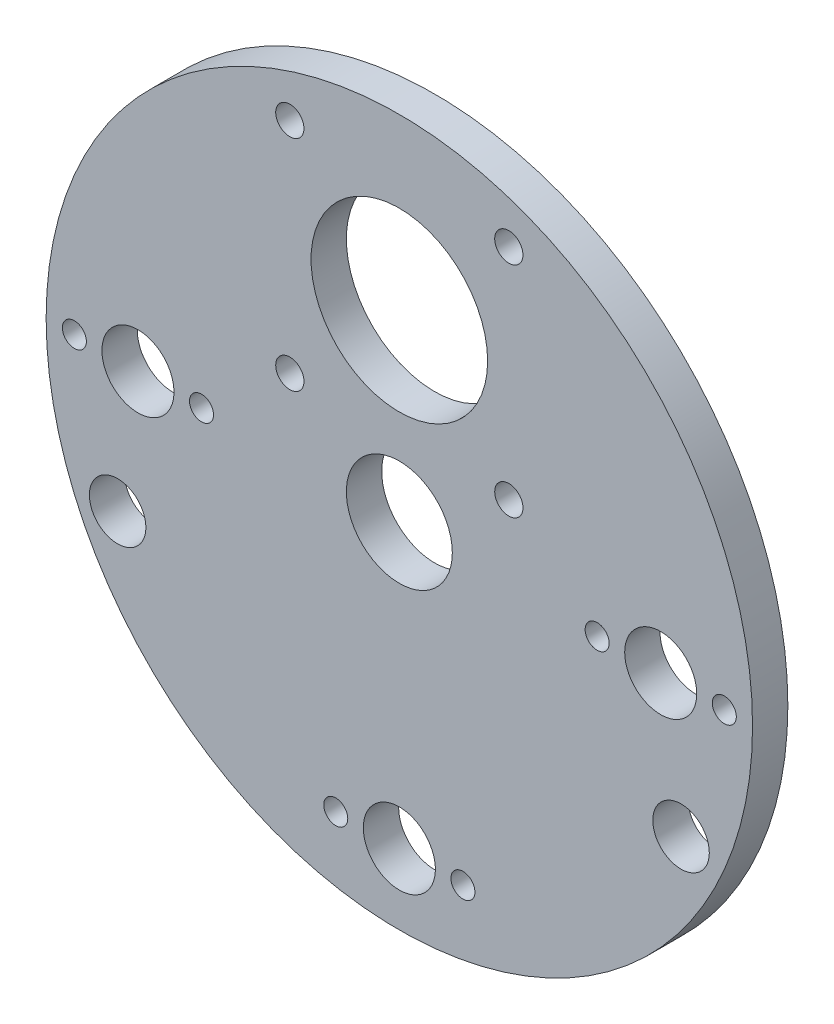
ISO-10303-21;
HEADER;
FILE_DESCRIPTION(('STEP AP214'),'2;1');
FILE_NAME('part.step','',(''),(''),'','','');
FILE_SCHEMA(('AUTOMOTIVE_DESIGN { 1 0 10303 214 1 1 1 1 }'));
ENDSEC;
DATA;
#1=APPLICATION_CONTEXT('core data for automotive mechanical design processes');
#2=APPLICATION_PROTOCOL_DEFINITION('international standard','automotive_design',2000,#1);
#3=PRODUCT_CONTEXT('',#1,'mechanical');
#4=PRODUCT('Part','Part','',(#3));
#5=PRODUCT_RELATED_PRODUCT_CATEGORY('part','',(#4));
#6=PRODUCT_DEFINITION_FORMATION('','',#4);
#7=PRODUCT_DEFINITION_CONTEXT('part definition',#1,'design');
#8=PRODUCT_DEFINITION('design','',#6,#7);
#9=PRODUCT_DEFINITION_SHAPE('','',#8);
#10=(LENGTH_UNIT() NAMED_UNIT(*) SI_UNIT(.MILLI.,.METRE.));
#11=(NAMED_UNIT(*) PLANE_ANGLE_UNIT() SI_UNIT($,.RADIAN.));
#12=(NAMED_UNIT(*) SI_UNIT($,.STERADIAN.) SOLID_ANGLE_UNIT());
#13=UNCERTAINTY_MEASURE_WITH_UNIT(LENGTH_MEASURE(1.E-05),#10,'distance_accuracy_value','');
#14=(GEOMETRIC_REPRESENTATION_CONTEXT(3) GLOBAL_UNCERTAINTY_ASSIGNED_CONTEXT((#13)) GLOBAL_UNIT_ASSIGNED_CONTEXT((#10,
#11,#12)) REPRESENTATION_CONTEXT('',''));
#15=CARTESIAN_POINT('',(0.,0.,0.));
#16=DIRECTION('',(0.,0.,1.));
#17=DIRECTION('',(1.,0.,0.));
#18=AXIS2_PLACEMENT_3D('',#15,#16,#17);
#19=CARTESIAN_POINT('',(0.,0.,5.));
#20=DIRECTION('',(0.,0.,-1.));
#21=DIRECTION('',(-1.,0.,0.));
#22=AXIS2_PLACEMENT_3D('',#19,#20,#21);
#23=CYLINDRICAL_SURFACE('',#22,50.);
#24=CARTESIAN_POINT('',(0.,0.,5.));
#25=DIRECTION('',(0.,0.,1.));
#26=DIRECTION('',(1.,0.,0.));
#27=AXIS2_PLACEMENT_3D('',#24,#25,#26);
#28=CIRCLE('',#27,50.);
#29=CARTESIAN_POINT('',(50.,0.,5.));
#30=VERTEX_POINT('',#29);
#31=EDGE_CURVE('E10',#30,#30,#28,.T.);
#32=ORIENTED_EDGE('',*,*,#31,.F.);
#33=EDGE_LOOP('',(#32));
#34=FACE_BOUND('',#33,.T.);
#35=CARTESIAN_POINT('',(0.,0.,0.));
#36=DIRECTION('',(0.,0.,1.));
#37=DIRECTION('',(1.,0.,0.));
#38=AXIS2_PLACEMENT_3D('',#35,#36,#37);
#39=CIRCLE('',#38,50.);
#40=CARTESIAN_POINT('',(50.,0.,0.));
#41=VERTEX_POINT('',#40);
#42=EDGE_CURVE('E39',#41,#41,#39,.T.);
#43=ORIENTED_EDGE('',*,*,#42,.T.);
#44=EDGE_LOOP('',(#43));
#45=FACE_BOUND('',#44,.T.);
#46=ADVANCED_FACE('F32',(#34,#45),#23,.T.);
#47=CARTESIAN_POINT('',(0.,0.,5.));
#48=DIRECTION('',(0.,0.,1.));
#49=DIRECTION('',(1.,0.,0.));
#50=AXIS2_PLACEMENT_3D('',#47,#48,#49);
#51=PLANE('',#50);
#52=CARTESIAN_POINT('',(0.,0.,5.));
#53=DIRECTION('',(0.,0.,1.));
#54=DIRECTION('',(1.,0.,0.));
#55=AXIS2_PLACEMENT_3D('',#52,#53,#54);
#56=CIRCLE('',#55,7.5);
#57=CARTESIAN_POINT('',(7.5,0.,5.));
#58=VERTEX_POINT('',#57);
#59=EDGE_CURVE('E172',#58,#58,#56,.T.);
#60=ORIENTED_EDGE('',*,*,#59,.F.);
#61=EDGE_LOOP('',(#60));
#62=FACE_BOUND('',#61,.T.);
#63=CARTESIAN_POINT('',(-39.8775426296126,-18.5952035165907,5.));
#64=DIRECTION('',(0.,0.,1.));
#65=DIRECTION('',(1.,0.,0.));
#66=AXIS2_PLACEMENT_3D('',#63,#64,#65);
#67=CIRCLE('',#66,4.00000000000001);
#68=CARTESIAN_POINT('',(-35.8775426296126,-18.5952035165907,5.));
#69=VERTEX_POINT('',#68);
#70=EDGE_CURVE('E71',#69,#69,#67,.T.);
#71=ORIENTED_EDGE('',*,*,#70,.F.);
#72=EDGE_LOOP('',(#71));
#73=FACE_BOUND('',#72,.T.);
#74=CARTESIAN_POINT('',(39.8775426296126,-18.5952035165907,5.));
#75=DIRECTION('',(0.,0.,1.));
#76=DIRECTION('',(-1.,0.,0.));
#77=AXIS2_PLACEMENT_3D('',#74,#75,#76);
#78=CIRCLE('',#77,4.00000000000001);
#79=CARTESIAN_POINT('',(35.8775426296126,-18.5952035165907,5.));
#80=VERTEX_POINT('',#79);
#81=EDGE_CURVE('E179',#80,#80,#78,.T.);
#82=ORIENTED_EDGE('',*,*,#81,.F.);
#83=EDGE_LOOP('',(#82));
#84=FACE_BOUND('',#83,.T.);
#85=CARTESIAN_POINT('',(-15.4999999999999,10.4999999999999,5.));
#86=DIRECTION('',(0.,0.,1.));
#87=DIRECTION('',(0.,1.,0.));
#88=AXIS2_PLACEMENT_3D('',#85,#86,#87);
#89=CIRCLE('',#88,2.);
#90=CARTESIAN_POINT('',(-15.4999999999999,12.4999999999999,5.));
#91=VERTEX_POINT('',#90);
#92=EDGE_CURVE('E62',#91,#91,#89,.T.);
#93=ORIENTED_EDGE('',*,*,#92,.F.);
#94=EDGE_LOOP('',(#93));
#95=FACE_BOUND('',#94,.T.);
#96=CARTESIAN_POINT('',(15.5,10.5,5.));
#97=DIRECTION('',(0.,0.,1.));
#98=DIRECTION('',(-1.,0.,0.));
#99=AXIS2_PLACEMENT_3D('',#96,#97,#98);
#100=CIRCLE('',#99,2.);
#101=CARTESIAN_POINT('',(13.5,10.5,5.));
#102=VERTEX_POINT('',#101);
#103=EDGE_CURVE('E77',#102,#102,#100,.T.);
#104=ORIENTED_EDGE('',*,*,#103,.F.);
#105=EDGE_LOOP('',(#104));
#106=FACE_BOUND('',#105,.T.);
#107=CARTESIAN_POINT('',(15.4999999999998,41.5000000000002,5.));
#108=DIRECTION('',(0.,0.,1.));
#109=DIRECTION('',(0.,-1.,0.));
#110=AXIS2_PLACEMENT_3D('',#107,#108,#109);
#111=CIRCLE('',#110,2.);
#112=CARTESIAN_POINT('',(15.4999999999999,39.5000000000002,5.));
#113=VERTEX_POINT('',#112);
#114=EDGE_CURVE('E73',#113,#113,#111,.T.);
#115=ORIENTED_EDGE('',*,*,#114,.F.);
#116=EDGE_LOOP('',(#115));
#117=FACE_BOUND('',#116,.T.);
#118=CARTESIAN_POINT('',(-15.5,41.5,5.));
#119=DIRECTION('',(0.,0.,1.));
#120=DIRECTION('',(1.,0.,0.));
#121=AXIS2_PLACEMENT_3D('',#118,#119,#120);
#122=CIRCLE('',#121,2.);
#123=CARTESIAN_POINT('',(-13.5,41.5,5.));
#124=VERTEX_POINT('',#123);
#125=EDGE_CURVE('E57',#124,#124,#122,.T.);
#126=ORIENTED_EDGE('',*,*,#125,.F.);
#127=EDGE_LOOP('',(#126));
#128=FACE_BOUND('',#127,.T.);
#129=CARTESIAN_POINT('',(0.,26.,5.));
#130=DIRECTION('',(0.,0.,1.));
#131=DIRECTION('',(1.,0.,0.));
#132=AXIS2_PLACEMENT_3D('',#129,#130,#131);
#133=CIRCLE('',#132,12.5);
#134=CARTESIAN_POINT('',(12.5,26.,5.));
#135=VERTEX_POINT('',#134);
#136=EDGE_CURVE('E53',#135,#135,#133,.T.);
#137=ORIENTED_EDGE('',*,*,#136,.F.);
#138=EDGE_LOOP('',(#137));
#139=FACE_BOUND('',#138,.T.);
#140=CARTESIAN_POINT('',(46.,0.,5.));
#141=DIRECTION('',(0.,0.,1.));
#142=DIRECTION('',(1.,0.,0.));
#143=AXIS2_PLACEMENT_3D('',#140,#141,#142);
#144=CIRCLE('',#143,1.7);
#145=CARTESIAN_POINT('',(47.7,0.,5.));
#146=VERTEX_POINT('',#145);
#147=EDGE_CURVE('E52',#146,#146,#144,.T.);
#148=ORIENTED_EDGE('',*,*,#147,.F.);
#149=EDGE_LOOP('',(#148));
#150=FACE_BOUND('',#149,.T.);
#151=CARTESIAN_POINT('',(28.,0.,5.));
#152=DIRECTION('',(0.,0.,1.));
#153=DIRECTION('',(1.,0.,0.));
#154=AXIS2_PLACEMENT_3D('',#151,#152,#153);
#155=CIRCLE('',#154,1.7);
#156=CARTESIAN_POINT('',(29.7,0.,5.));
#157=VERTEX_POINT('',#156);
#158=EDGE_CURVE('E94',#157,#157,#155,.T.);
#159=ORIENTED_EDGE('',*,*,#158,.F.);
#160=EDGE_LOOP('',(#159));
#161=FACE_BOUND('',#160,.T.);
#162=CARTESIAN_POINT('',(9.,-40.,5.));
#163=DIRECTION('',(0.,0.,1.));
#164=DIRECTION('',(1.,0.,0.));
#165=AXIS2_PLACEMENT_3D('',#162,#163,#164);
#166=CIRCLE('',#165,1.7);
#167=CARTESIAN_POINT('',(10.7,-40.,5.));
#168=VERTEX_POINT('',#167);
#169=EDGE_CURVE('E100',#168,#168,#166,.T.);
#170=ORIENTED_EDGE('',*,*,#169,.F.);
#171=EDGE_LOOP('',(#170));
#172=FACE_BOUND('',#171,.T.);
#173=CARTESIAN_POINT('',(-9.,-40.,5.));
#174=DIRECTION('',(0.,0.,1.));
#175=DIRECTION('',(1.,0.,0.));
#176=AXIS2_PLACEMENT_3D('',#173,#174,#175);
#177=CIRCLE('',#176,1.7);
#178=CARTESIAN_POINT('',(-7.3,-40.,5.));
#179=VERTEX_POINT('',#178);
#180=EDGE_CURVE('E106',#179,#179,#177,.T.);
#181=ORIENTED_EDGE('',*,*,#180,.F.);
#182=EDGE_LOOP('',(#181));
#183=FACE_BOUND('',#182,.T.);
#184=CARTESIAN_POINT('',(-46.,2.97129651685814E-13,5.));
#185=DIRECTION('',(0.,0.,1.));
#186=DIRECTION('',(1.,0.,0.));
#187=AXIS2_PLACEMENT_3D('',#184,#185,#186);
#188=CIRCLE('',#187,1.7);
#189=CARTESIAN_POINT('',(-44.3,2.97129651685814E-13,5.));
#190=VERTEX_POINT('',#189);
#191=EDGE_CURVE('E112',#190,#190,#188,.T.);
#192=ORIENTED_EDGE('',*,*,#191,.F.);
#193=EDGE_LOOP('',(#192));
#194=FACE_BOUND('',#193,.T.);
#195=CARTESIAN_POINT('',(-28.,-1.71810817162361E-12,5.));
#196=DIRECTION('',(0.,0.,1.));
#197=DIRECTION('',(1.,0.,0.));
#198=AXIS2_PLACEMENT_3D('',#195,#196,#197);
#199=CIRCLE('',#198,1.7);
#200=CARTESIAN_POINT('',(-26.3,-1.71810817162361E-12,5.));
#201=VERTEX_POINT('',#200);
#202=EDGE_CURVE('E118',#201,#201,#199,.T.);
#203=ORIENTED_EDGE('',*,*,#202,.F.);
#204=EDGE_LOOP('',(#203));
#205=FACE_BOUND('',#204,.T.);
#206=CARTESIAN_POINT('',(-37.,0.,5.));
#207=DIRECTION('',(0.,0.,-1.));
#208=DIRECTION('',(-1.,0.,0.));
#209=AXIS2_PLACEMENT_3D('',#206,#207,#208);
#210=CIRCLE('',#209,5.1);
#211=CARTESIAN_POINT('',(-42.1,0.,5.));
#212=VERTEX_POINT('',#211);
#213=EDGE_CURVE('E127',#212,#212,#210,.T.);
#214=ORIENTED_EDGE('',*,*,#213,.T.);
#215=EDGE_LOOP('',(#214));
#216=FACE_BOUND('',#215,.T.);
#217=CARTESIAN_POINT('',(37.,2.68166793467571E-13,5.));
#218=DIRECTION('',(0.,0.,-1.));
#219=DIRECTION('',(-1.,0.,0.));
#220=AXIS2_PLACEMENT_3D('',#217,#218,#219);
#221=CIRCLE('',#220,5.1);
#222=CARTESIAN_POINT('',(31.9,2.68166793467571E-13,5.));
#223=VERTEX_POINT('',#222);
#224=EDGE_CURVE('E133',#223,#223,#221,.T.);
#225=ORIENTED_EDGE('',*,*,#224,.T.);
#226=EDGE_LOOP('',(#225));
#227=FACE_BOUND('',#226,.T.);
#228=CARTESIAN_POINT('',(0.,-40.,5.));
#229=DIRECTION('',(0.,0.,-1.));
#230=DIRECTION('',(-1.,0.,0.));
#231=AXIS2_PLACEMENT_3D('',#228,#229,#230);
#232=CIRCLE('',#231,5.1);
#233=CARTESIAN_POINT('',(-5.1,-40.,5.));
#234=VERTEX_POINT('',#233);
#235=EDGE_CURVE('E44',#234,#234,#232,.T.);
#236=ORIENTED_EDGE('',*,*,#235,.T.);
#237=EDGE_LOOP('',(#236));
#238=FACE_BOUND('',#237,.T.);
#239=ORIENTED_EDGE('',*,*,#31,.T.);
#240=EDGE_LOOP('',(#239));
#241=FACE_BOUND('',#240,.T.);
#242=ADVANCED_FACE('F142',(#62,#73,#84,#95,#106,#117,#128,#139,#150,#161,#172,#183,#194,#205,
#216,#227,#238,#241),#51,.T.);
#243=CARTESIAN_POINT('',(0.,0.,0.));
#244=DIRECTION('',(0.,0.,1.));
#245=DIRECTION('',(1.,0.,0.));
#246=AXIS2_PLACEMENT_3D('',#243,#244,#245);
#247=PLANE('',#246);
#248=CARTESIAN_POINT('',(0.,0.,0.));
#249=DIRECTION('',(0.,0.,1.));
#250=DIRECTION('',(1.,0.,0.));
#251=AXIS2_PLACEMENT_3D('',#248,#249,#250);
#252=CIRCLE('',#251,7.5);
#253=CARTESIAN_POINT('',(7.5,0.,0.));
#254=VERTEX_POINT('',#253);
#255=EDGE_CURVE('E35',#254,#254,#252,.T.);
#256=ORIENTED_EDGE('',*,*,#255,.T.);
#257=EDGE_LOOP('',(#256));
#258=FACE_BOUND('',#257,.T.);
#259=CARTESIAN_POINT('',(-39.8775426296126,-18.5952035165907,0.));
#260=DIRECTION('',(0.,0.,1.));
#261=DIRECTION('',(1.,0.,0.));
#262=AXIS2_PLACEMENT_3D('',#259,#260,#261);
#263=CIRCLE('',#262,4.00000000000001);
#264=CARTESIAN_POINT('',(-35.8775426296126,-18.5952035165907,0.));
#265=VERTEX_POINT('',#264);
#266=EDGE_CURVE('E70',#265,#265,#263,.T.);
#267=ORIENTED_EDGE('',*,*,#266,.T.);
#268=EDGE_LOOP('',(#267));
#269=FACE_BOUND('',#268,.T.);
#270=CARTESIAN_POINT('',(39.8775426296126,-18.5952035165907,0.));
#271=DIRECTION('',(0.,0.,1.));
#272=DIRECTION('',(1.,0.,0.));
#273=AXIS2_PLACEMENT_3D('',#270,#271,#272);
#274=CIRCLE('',#273,4.00000000000001);
#275=CARTESIAN_POINT('',(43.8775426296126,-18.5952035165907,0.));
#276=VERTEX_POINT('',#275);
#277=EDGE_CURVE('E68',#276,#276,#274,.T.);
#278=ORIENTED_EDGE('',*,*,#277,.T.);
#279=EDGE_LOOP('',(#278));
#280=FACE_BOUND('',#279,.T.);
#281=CARTESIAN_POINT('',(-15.4999999999999,10.4999999999999,0.));
#282=DIRECTION('',(0.,0.,1.));
#283=DIRECTION('',(1.,0.,0.));
#284=AXIS2_PLACEMENT_3D('',#281,#282,#283);
#285=CIRCLE('',#284,2.);
#286=CARTESIAN_POINT('',(-13.4999999999999,10.4999999999999,0.));
#287=VERTEX_POINT('',#286);
#288=EDGE_CURVE('E65',#287,#287,#285,.T.);
#289=ORIENTED_EDGE('',*,*,#288,.T.);
#290=EDGE_LOOP('',(#289));
#291=FACE_BOUND('',#290,.T.);
#292=CARTESIAN_POINT('',(15.5,10.5,0.));
#293=DIRECTION('',(0.,0.,1.));
#294=DIRECTION('',(1.,0.,0.));
#295=AXIS2_PLACEMENT_3D('',#292,#293,#294);
#296=CIRCLE('',#295,2.);
#297=CARTESIAN_POINT('',(17.5,10.5,0.));
#298=VERTEX_POINT('',#297);
#299=EDGE_CURVE('E61',#298,#298,#296,.T.);
#300=ORIENTED_EDGE('',*,*,#299,.T.);
#301=EDGE_LOOP('',(#300));
#302=FACE_BOUND('',#301,.T.);
#303=CARTESIAN_POINT('',(15.4999999999998,41.5000000000002,0.));
#304=DIRECTION('',(0.,0.,1.));
#305=DIRECTION('',(1.,0.,0.));
#306=AXIS2_PLACEMENT_3D('',#303,#304,#305);
#307=CIRCLE('',#306,2.);
#308=CARTESIAN_POINT('',(17.4999999999998,41.5000000000002,0.));
#309=VERTEX_POINT('',#308);
#310=EDGE_CURVE('E58',#309,#309,#307,.T.);
#311=ORIENTED_EDGE('',*,*,#310,.T.);
#312=EDGE_LOOP('',(#311));
#313=FACE_BOUND('',#312,.T.);
#314=CARTESIAN_POINT('',(-15.5,41.5,0.));
#315=DIRECTION('',(0.,0.,1.));
#316=DIRECTION('',(1.,0.,0.));
#317=AXIS2_PLACEMENT_3D('',#314,#315,#316);
#318=CIRCLE('',#317,2.);
#319=CARTESIAN_POINT('',(-13.5,41.5,0.));
#320=VERTEX_POINT('',#319);
#321=EDGE_CURVE('E54',#320,#320,#318,.T.);
#322=ORIENTED_EDGE('',*,*,#321,.T.);
#323=EDGE_LOOP('',(#322));
#324=FACE_BOUND('',#323,.T.);
#325=CARTESIAN_POINT('',(0.,26.,0.));
#326=DIRECTION('',(0.,0.,1.));
#327=DIRECTION('',(1.,0.,0.));
#328=AXIS2_PLACEMENT_3D('',#325,#326,#327);
#329=CIRCLE('',#328,12.5);
#330=CARTESIAN_POINT('',(12.5,26.,0.));
#331=VERTEX_POINT('',#330);
#332=EDGE_CURVE('E49',#331,#331,#329,.T.);
#333=ORIENTED_EDGE('',*,*,#332,.T.);
#334=EDGE_LOOP('',(#333));
#335=FACE_BOUND('',#334,.T.);
#336=CARTESIAN_POINT('',(46.,0.,0.));
#337=DIRECTION('',(0.,0.,1.));
#338=DIRECTION('',(1.,0.,0.));
#339=AXIS2_PLACEMENT_3D('',#336,#337,#338);
#340=CIRCLE('',#339,1.7);
#341=CARTESIAN_POINT('',(47.7,0.,0.));
#342=VERTEX_POINT('',#341);
#343=EDGE_CURVE('E91',#342,#342,#340,.T.);
#344=ORIENTED_EDGE('',*,*,#343,.T.);
#345=EDGE_LOOP('',(#344));
#346=FACE_BOUND('',#345,.T.);
#347=CARTESIAN_POINT('',(28.,0.,0.));
#348=DIRECTION('',(0.,0.,1.));
#349=DIRECTION('',(1.,0.,0.));
#350=AXIS2_PLACEMENT_3D('',#347,#348,#349);
#351=CIRCLE('',#350,1.7);
#352=CARTESIAN_POINT('',(29.7,0.,0.));
#353=VERTEX_POINT('',#352);
#354=EDGE_CURVE('E97',#353,#353,#351,.T.);
#355=ORIENTED_EDGE('',*,*,#354,.T.);
#356=EDGE_LOOP('',(#355));
#357=FACE_BOUND('',#356,.T.);
#358=CARTESIAN_POINT('',(9.,-40.,0.));
#359=DIRECTION('',(0.,0.,1.));
#360=DIRECTION('',(1.,0.,0.));
#361=AXIS2_PLACEMENT_3D('',#358,#359,#360);
#362=CIRCLE('',#361,1.7);
#363=CARTESIAN_POINT('',(10.7,-40.,0.));
#364=VERTEX_POINT('',#363);
#365=EDGE_CURVE('E103',#364,#364,#362,.T.);
#366=ORIENTED_EDGE('',*,*,#365,.T.);
#367=EDGE_LOOP('',(#366));
#368=FACE_BOUND('',#367,.T.);
#369=CARTESIAN_POINT('',(-9.,-40.,0.));
#370=DIRECTION('',(0.,0.,1.));
#371=DIRECTION('',(1.,0.,0.));
#372=AXIS2_PLACEMENT_3D('',#369,#370,#371);
#373=CIRCLE('',#372,1.7);
#374=CARTESIAN_POINT('',(-7.3,-40.,0.));
#375=VERTEX_POINT('',#374);
#376=EDGE_CURVE('E109',#375,#375,#373,.T.);
#377=ORIENTED_EDGE('',*,*,#376,.T.);
#378=EDGE_LOOP('',(#377));
#379=FACE_BOUND('',#378,.T.);
#380=CARTESIAN_POINT('',(-46.,2.97129651685814E-13,0.));
#381=DIRECTION('',(0.,0.,1.));
#382=DIRECTION('',(1.,0.,0.));
#383=AXIS2_PLACEMENT_3D('',#380,#381,#382);
#384=CIRCLE('',#383,1.7);
#385=CARTESIAN_POINT('',(-44.3,2.97129651685814E-13,0.));
#386=VERTEX_POINT('',#385);
#387=EDGE_CURVE('E115',#386,#386,#384,.T.);
#388=ORIENTED_EDGE('',*,*,#387,.T.);
#389=EDGE_LOOP('',(#388));
#390=FACE_BOUND('',#389,.T.);
#391=CARTESIAN_POINT('',(-28.,-1.71810817162361E-12,0.));
#392=DIRECTION('',(0.,0.,1.));
#393=DIRECTION('',(1.,0.,0.));
#394=AXIS2_PLACEMENT_3D('',#391,#392,#393);
#395=CIRCLE('',#394,1.7);
#396=CARTESIAN_POINT('',(-26.3,-1.71810817162361E-12,0.));
#397=VERTEX_POINT('',#396);
#398=EDGE_CURVE('E121',#397,#397,#395,.T.);
#399=ORIENTED_EDGE('',*,*,#398,.T.);
#400=EDGE_LOOP('',(#399));
#401=FACE_BOUND('',#400,.T.);
#402=CARTESIAN_POINT('',(-37.,0.,0.));
#403=DIRECTION('',(0.,0.,-1.));
#404=DIRECTION('',(-1.,0.,0.));
#405=AXIS2_PLACEMENT_3D('',#402,#403,#404);
#406=CIRCLE('',#405,5.1);
#407=CARTESIAN_POINT('',(-42.1,0.,0.));
#408=VERTEX_POINT('',#407);
#409=EDGE_CURVE('E124',#408,#408,#406,.T.);
#410=ORIENTED_EDGE('',*,*,#409,.F.);
#411=EDGE_LOOP('',(#410));
#412=FACE_BOUND('',#411,.T.);
#413=CARTESIAN_POINT('',(37.,2.68166793467571E-13,0.));
#414=DIRECTION('',(0.,0.,-1.));
#415=DIRECTION('',(-1.,0.,0.));
#416=AXIS2_PLACEMENT_3D('',#413,#414,#415);
#417=CIRCLE('',#416,5.1);
#418=CARTESIAN_POINT('',(31.9,2.68166793467571E-13,0.));
#419=VERTEX_POINT('',#418);
#420=EDGE_CURVE('E130',#419,#419,#417,.T.);
#421=ORIENTED_EDGE('',*,*,#420,.F.);
#422=EDGE_LOOP('',(#421));
#423=FACE_BOUND('',#422,.T.);
#424=CARTESIAN_POINT('',(0.,-40.,0.));
#425=DIRECTION('',(0.,0.,-1.));
#426=DIRECTION('',(-1.,0.,0.));
#427=AXIS2_PLACEMENT_3D('',#424,#425,#426);
#428=CIRCLE('',#427,5.1);
#429=CARTESIAN_POINT('',(-5.1,-40.,0.));
#430=VERTEX_POINT('',#429);
#431=EDGE_CURVE('E135',#430,#430,#428,.T.);
#432=ORIENTED_EDGE('',*,*,#431,.F.);
#433=EDGE_LOOP('',(#432));
#434=FACE_BOUND('',#433,.T.);
#435=ORIENTED_EDGE('',*,*,#42,.F.);
#436=EDGE_LOOP('',(#435));
#437=FACE_BOUND('',#436,.T.);
#438=ADVANCED_FACE('F147',(#258,#269,#280,#291,#302,#313,#324,#335,#346,#357,#368,#379,#390,
#401,#412,#423,#434,#437),#247,.F.);
#439=CARTESIAN_POINT('',(0.,-40.,0.));
#440=DIRECTION('',(0.,0.,-1.));
#441=DIRECTION('',(-1.,0.,0.));
#442=AXIS2_PLACEMENT_3D('',#439,#440,#441);
#443=CYLINDRICAL_SURFACE('',#442,5.1);
#444=ORIENTED_EDGE('',*,*,#235,.F.);
#445=EDGE_LOOP('',(#444));
#446=FACE_BOUND('',#445,.T.);
#447=ORIENTED_EDGE('',*,*,#431,.T.);
#448=EDGE_LOOP('',(#447));
#449=FACE_BOUND('',#448,.T.);
#450=ADVANCED_FACE('F144',(#446,#449),#443,.F.);
#451=CARTESIAN_POINT('',(37.,2.68166793467571E-13,0.));
#452=DIRECTION('',(0.,0.,-1.));
#453=DIRECTION('',(-1.,0.,0.));
#454=AXIS2_PLACEMENT_3D('',#451,#452,#453);
#455=CYLINDRICAL_SURFACE('',#454,5.1);
#456=ORIENTED_EDGE('',*,*,#224,.F.);
#457=EDGE_LOOP('',(#456));
#458=FACE_BOUND('',#457,.T.);
#459=ORIENTED_EDGE('',*,*,#420,.T.);
#460=EDGE_LOOP('',(#459));
#461=FACE_BOUND('',#460,.T.);
#462=ADVANCED_FACE('F146',(#458,#461),#455,.F.);
#463=CARTESIAN_POINT('',(-37.,0.,0.));
#464=DIRECTION('',(0.,0.,-1.));
#465=DIRECTION('',(-1.,0.,0.));
#466=AXIS2_PLACEMENT_3D('',#463,#464,#465);
#467=CYLINDRICAL_SURFACE('',#466,5.1);
#468=ORIENTED_EDGE('',*,*,#213,.F.);
#469=EDGE_LOOP('',(#468));
#470=FACE_BOUND('',#469,.T.);
#471=ORIENTED_EDGE('',*,*,#409,.T.);
#472=EDGE_LOOP('',(#471));
#473=FACE_BOUND('',#472,.T.);
#474=ADVANCED_FACE('F153',(#470,#473),#467,.F.);
#475=CARTESIAN_POINT('',(-28.,-1.71810817162361E-12,5.));
#476=DIRECTION('',(0.,0.,1.));
#477=DIRECTION('',(1.,0.,0.));
#478=AXIS2_PLACEMENT_3D('',#475,#476,#477);
#479=CYLINDRICAL_SURFACE('',#478,1.7);
#480=ORIENTED_EDGE('',*,*,#398,.F.);
#481=EDGE_LOOP('',(#480));
#482=FACE_BOUND('',#481,.T.);
#483=ORIENTED_EDGE('',*,*,#202,.T.);
#484=EDGE_LOOP('',(#483));
#485=FACE_BOUND('',#484,.T.);
#486=ADVANCED_FACE('F212',(#482,#485),#479,.F.);
#487=CARTESIAN_POINT('',(-46.,2.97129651685814E-13,5.));
#488=DIRECTION('',(0.,0.,1.));
#489=DIRECTION('',(1.,0.,0.));
#490=AXIS2_PLACEMENT_3D('',#487,#488,#489);
#491=CYLINDRICAL_SURFACE('',#490,1.7);
#492=ORIENTED_EDGE('',*,*,#387,.F.);
#493=EDGE_LOOP('',(#492));
#494=FACE_BOUND('',#493,.T.);
#495=ORIENTED_EDGE('',*,*,#191,.T.);
#496=EDGE_LOOP('',(#495));
#497=FACE_BOUND('',#496,.T.);
#498=ADVANCED_FACE('F219',(#494,#497),#491,.F.);
#499=CARTESIAN_POINT('',(-9.,-40.,5.));
#500=DIRECTION('',(0.,0.,1.));
#501=DIRECTION('',(1.,0.,0.));
#502=AXIS2_PLACEMENT_3D('',#499,#500,#501);
#503=CYLINDRICAL_SURFACE('',#502,1.7);
#504=ORIENTED_EDGE('',*,*,#376,.F.);
#505=EDGE_LOOP('',(#504));
#506=FACE_BOUND('',#505,.T.);
#507=ORIENTED_EDGE('',*,*,#180,.T.);
#508=EDGE_LOOP('',(#507));
#509=FACE_BOUND('',#508,.T.);
#510=ADVANCED_FACE('F225',(#506,#509),#503,.F.);
#511=CARTESIAN_POINT('',(9.,-40.,5.));
#512=DIRECTION('',(0.,0.,1.));
#513=DIRECTION('',(1.,0.,0.));
#514=AXIS2_PLACEMENT_3D('',#511,#512,#513);
#515=CYLINDRICAL_SURFACE('',#514,1.7);
#516=ORIENTED_EDGE('',*,*,#365,.F.);
#517=EDGE_LOOP('',(#516));
#518=FACE_BOUND('',#517,.T.);
#519=ORIENTED_EDGE('',*,*,#169,.T.);
#520=EDGE_LOOP('',(#519));
#521=FACE_BOUND('',#520,.T.);
#522=ADVANCED_FACE('F229',(#518,#521),#515,.F.);
#523=CARTESIAN_POINT('',(28.,0.,5.));
#524=DIRECTION('',(0.,0.,1.));
#525=DIRECTION('',(1.,0.,0.));
#526=AXIS2_PLACEMENT_3D('',#523,#524,#525);
#527=CYLINDRICAL_SURFACE('',#526,1.7);
#528=ORIENTED_EDGE('',*,*,#354,.F.);
#529=EDGE_LOOP('',(#528));
#530=FACE_BOUND('',#529,.T.);
#531=ORIENTED_EDGE('',*,*,#158,.T.);
#532=EDGE_LOOP('',(#531));
#533=FACE_BOUND('',#532,.T.);
#534=ADVANCED_FACE('F233',(#530,#533),#527,.F.);
#535=CARTESIAN_POINT('',(46.,0.,5.));
#536=DIRECTION('',(0.,0.,1.));
#537=DIRECTION('',(1.,0.,0.));
#538=AXIS2_PLACEMENT_3D('',#535,#536,#537);
#539=CYLINDRICAL_SURFACE('',#538,1.7);
#540=ORIENTED_EDGE('',*,*,#343,.F.);
#541=EDGE_LOOP('',(#540));
#542=FACE_BOUND('',#541,.T.);
#543=ORIENTED_EDGE('',*,*,#147,.T.);
#544=EDGE_LOOP('',(#543));
#545=FACE_BOUND('',#544,.T.);
#546=ADVANCED_FACE('F237',(#542,#545),#539,.F.);
#547=CARTESIAN_POINT('',(0.,26.,-5.));
#548=DIRECTION('',(0.,0.,1.));
#549=DIRECTION('',(1.,0.,0.));
#550=AXIS2_PLACEMENT_3D('',#547,#548,#549);
#551=CYLINDRICAL_SURFACE('',#550,12.5);
#552=ORIENTED_EDGE('',*,*,#136,.T.);
#553=EDGE_LOOP('',(#552));
#554=FACE_BOUND('',#553,.T.);
#555=ORIENTED_EDGE('',*,*,#332,.F.);
#556=EDGE_LOOP('',(#555));
#557=FACE_BOUND('',#556,.T.);
#558=ADVANCED_FACE('F241',(#554,#557),#551,.F.);
#559=CARTESIAN_POINT('',(-15.5,41.5,-5.));
#560=DIRECTION('',(0.,0.,1.));
#561=DIRECTION('',(1.,0.,0.));
#562=AXIS2_PLACEMENT_3D('',#559,#560,#561);
#563=CYLINDRICAL_SURFACE('',#562,2.);
#564=ORIENTED_EDGE('',*,*,#125,.T.);
#565=EDGE_LOOP('',(#564));
#566=FACE_BOUND('',#565,.T.);
#567=ORIENTED_EDGE('',*,*,#321,.F.);
#568=EDGE_LOOP('',(#567));
#569=FACE_BOUND('',#568,.T.);
#570=ADVANCED_FACE('F245',(#566,#569),#563,.F.);
#571=CARTESIAN_POINT('',(15.4999999999998,41.5000000000002,-5.));
#572=DIRECTION('',(0.,0.,1.));
#573=DIRECTION('',(1.,0.,0.));
#574=AXIS2_PLACEMENT_3D('',#571,#572,#573);
#575=CYLINDRICAL_SURFACE('',#574,2.);
#576=ORIENTED_EDGE('',*,*,#114,.T.);
#577=EDGE_LOOP('',(#576));
#578=FACE_BOUND('',#577,.T.);
#579=ORIENTED_EDGE('',*,*,#310,.F.);
#580=EDGE_LOOP('',(#579));
#581=FACE_BOUND('',#580,.T.);
#582=ADVANCED_FACE('F249',(#578,#581),#575,.F.);
#583=CARTESIAN_POINT('',(15.5,10.5,-5.));
#584=DIRECTION('',(0.,0.,1.));
#585=DIRECTION('',(1.,0.,0.));
#586=AXIS2_PLACEMENT_3D('',#583,#584,#585);
#587=CYLINDRICAL_SURFACE('',#586,2.);
#588=ORIENTED_EDGE('',*,*,#103,.T.);
#589=EDGE_LOOP('',(#588));
#590=FACE_BOUND('',#589,.T.);
#591=ORIENTED_EDGE('',*,*,#299,.F.);
#592=EDGE_LOOP('',(#591));
#593=FACE_BOUND('',#592,.T.);
#594=ADVANCED_FACE('F253',(#590,#593),#587,.F.);
#595=CARTESIAN_POINT('',(-15.4999999999999,10.4999999999999,-5.));
#596=DIRECTION('',(0.,0.,1.));
#597=DIRECTION('',(1.,0.,0.));
#598=AXIS2_PLACEMENT_3D('',#595,#596,#597);
#599=CYLINDRICAL_SURFACE('',#598,2.);
#600=ORIENTED_EDGE('',*,*,#92,.T.);
#601=EDGE_LOOP('',(#600));
#602=FACE_BOUND('',#601,.T.);
#603=ORIENTED_EDGE('',*,*,#288,.F.);
#604=EDGE_LOOP('',(#603));
#605=FACE_BOUND('',#604,.T.);
#606=ADVANCED_FACE('F256',(#602,#605),#599,.F.);
#607=CARTESIAN_POINT('',(39.8775426296126,-18.5952035165907,-5.));
#608=DIRECTION('',(0.,0.,1.));
#609=DIRECTION('',(1.,0.,0.));
#610=AXIS2_PLACEMENT_3D('',#607,#608,#609);
#611=CYLINDRICAL_SURFACE('',#610,4.00000000000001);
#612=ORIENTED_EDGE('',*,*,#81,.T.);
#613=EDGE_LOOP('',(#612));
#614=FACE_BOUND('',#613,.T.);
#615=ORIENTED_EDGE('',*,*,#277,.F.);
#616=EDGE_LOOP('',(#615));
#617=FACE_BOUND('',#616,.T.);
#618=ADVANCED_FACE('F260',(#614,#617),#611,.F.);
#619=CARTESIAN_POINT('',(-39.8775426296126,-18.5952035165907,-5.));
#620=DIRECTION('',(0.,0.,1.));
#621=DIRECTION('',(1.,0.,0.));
#622=AXIS2_PLACEMENT_3D('',#619,#620,#621);
#623=CYLINDRICAL_SURFACE('',#622,4.00000000000001);
#624=ORIENTED_EDGE('',*,*,#70,.T.);
#625=EDGE_LOOP('',(#624));
#626=FACE_BOUND('',#625,.T.);
#627=ORIENTED_EDGE('',*,*,#266,.F.);
#628=EDGE_LOOP('',(#627));
#629=FACE_BOUND('',#628,.T.);
#630=ADVANCED_FACE('F264',(#626,#629),#623,.F.);
#631=CARTESIAN_POINT('',(0.,0.,-5.));
#632=DIRECTION('',(0.,0.,1.));
#633=DIRECTION('',(1.,0.,0.));
#634=AXIS2_PLACEMENT_3D('',#631,#632,#633);
#635=CYLINDRICAL_SURFACE('',#634,7.5);
#636=ORIENTED_EDGE('',*,*,#59,.T.);
#637=EDGE_LOOP('',(#636));
#638=FACE_BOUND('',#637,.T.);
#639=ORIENTED_EDGE('',*,*,#255,.F.);
#640=EDGE_LOOP('',(#639));
#641=FACE_BOUND('',#640,.T.);
#642=ADVANCED_FACE('F268',(#638,#641),#635,.F.);
#643=CLOSED_SHELL('',(#46,#242,#438,#450,#462,#474,#486,#498,#510,#522,#534,#546,#558,#570,#582,
#594,#606,#618,#630,#642));
#644=MANIFOLD_SOLID_BREP('B2',#643);
#645=ADVANCED_BREP_SHAPE_REPRESENTATION('',(#18,#644),#14);
#646=SHAPE_DEFINITION_REPRESENTATION(#9,#645);
ENDSEC;
END-ISO-10303-21;
